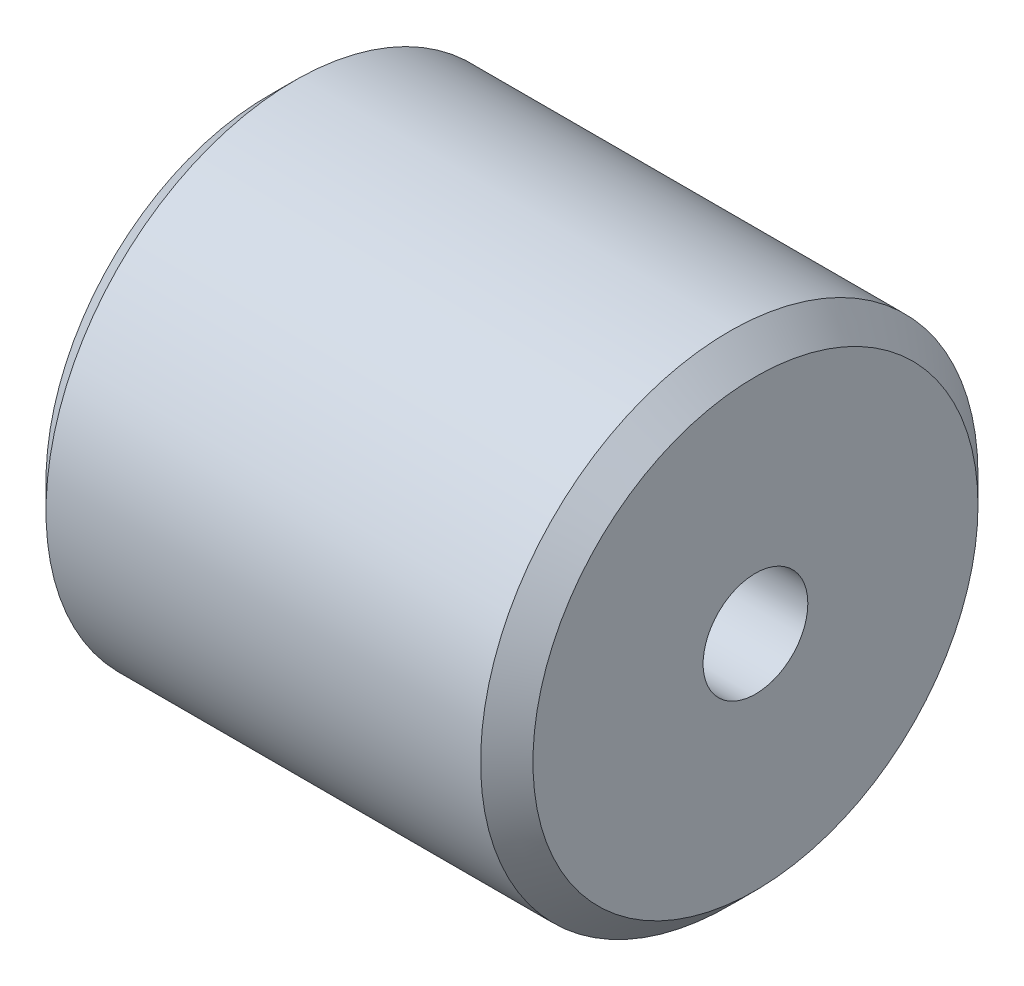
ISO-10303-21;
HEADER;
FILE_DESCRIPTION(('STEP AP214'),'2;1');
FILE_NAME('part.step','',(''),(''),'','','');
FILE_SCHEMA(('AUTOMOTIVE_DESIGN { 1 0 10303 214 1 1 1 1 }'));
ENDSEC;
DATA;
#1=APPLICATION_CONTEXT('core data for automotive mechanical design processes');
#2=APPLICATION_PROTOCOL_DEFINITION('international standard','automotive_design',2000,#1);
#3=PRODUCT_CONTEXT('',#1,'mechanical');
#4=PRODUCT('Part','Part','',(#3));
#5=PRODUCT_RELATED_PRODUCT_CATEGORY('part','',(#4));
#6=PRODUCT_DEFINITION_FORMATION('','',#4);
#7=PRODUCT_DEFINITION_CONTEXT('part definition',#1,'design');
#8=PRODUCT_DEFINITION('design','',#6,#7);
#9=PRODUCT_DEFINITION_SHAPE('','',#8);
#10=(LENGTH_UNIT() NAMED_UNIT(*) SI_UNIT(.MILLI.,.METRE.));
#11=(NAMED_UNIT(*) PLANE_ANGLE_UNIT() SI_UNIT($,.RADIAN.));
#12=(NAMED_UNIT(*) SI_UNIT($,.STERADIAN.) SOLID_ANGLE_UNIT());
#13=UNCERTAINTY_MEASURE_WITH_UNIT(LENGTH_MEASURE(1.E-05),#10,'distance_accuracy_value','');
#14=(GEOMETRIC_REPRESENTATION_CONTEXT(3) GLOBAL_UNCERTAINTY_ASSIGNED_CONTEXT((#13)) GLOBAL_UNIT_ASSIGNED_CONTEXT((#10,
#11,#12)) REPRESENTATION_CONTEXT('',''));
#15=CARTESIAN_POINT('',(0.,0.,0.));
#16=DIRECTION('',(0.,0.,1.));
#17=DIRECTION('',(1.,0.,0.));
#18=AXIS2_PLACEMENT_3D('',#15,#16,#17);
#19=CARTESIAN_POINT('',(-0.699999999999999,0.,0.));
#20=DIRECTION('',(1.,0.,0.));
#21=DIRECTION('',(0.,0.,-1.));
#22=AXIS2_PLACEMENT_3D('',#19,#20,#21);
#23=CYLINDRICAL_SURFACE('',#22,2.);
#24=CARTESIAN_POINT('',(-9.3,0.,0.));
#25=DIRECTION('',(1.,0.,0.));
#26=DIRECTION('',(0.,0.,-1.));
#27=AXIS2_PLACEMENT_3D('',#24,#25,#26);
#28=CIRCLE('',#27,2.);
#29=CARTESIAN_POINT('',(-9.3,0.,-2.));
#30=VERTEX_POINT('',#29);
#31=EDGE_CURVE('E10',#30,#30,#28,.T.);
#32=ORIENTED_EDGE('',*,*,#31,.F.);
#33=EDGE_LOOP('',(#32));
#34=FACE_BOUND('',#33,.T.);
#35=CARTESIAN_POINT('',(9.3,0.,0.));
#36=DIRECTION('',(1.,0.,0.));
#37=DIRECTION('',(0.,0.,-1.));
#38=AXIS2_PLACEMENT_3D('',#35,#36,#37);
#39=CIRCLE('',#38,2.);
#40=CARTESIAN_POINT('',(9.3,0.,-2.));
#41=VERTEX_POINT('',#40);
#42=EDGE_CURVE('E23',#41,#41,#39,.T.);
#43=ORIENTED_EDGE('',*,*,#42,.T.);
#44=EDGE_LOOP('',(#43));
#45=FACE_BOUND('',#44,.T.);
#46=ADVANCED_FACE('F14',(#34,#45),#23,.F.);
#47=CARTESIAN_POINT('',(9.3,0.,0.));
#48=DIRECTION('',(1.,0.,0.));
#49=DIRECTION('',(0.,0.,-1.));
#50=AXIS2_PLACEMENT_3D('',#47,#48,#49);
#51=PLANE('',#50);
#52=CARTESIAN_POINT('',(9.3,0.,0.));
#53=DIRECTION('',(1.,0.,0.));
#54=DIRECTION('',(0.,0.,-1.));
#55=AXIS2_PLACEMENT_3D('',#52,#53,#54);
#56=CIRCLE('',#55,8.5);
#57=CARTESIAN_POINT('',(9.3,0.,-8.5));
#58=VERTEX_POINT('',#57);
#59=EDGE_CURVE('E31',#58,#58,#56,.T.);
#60=ORIENTED_EDGE('',*,*,#59,.T.);
#61=EDGE_LOOP('',(#60));
#62=FACE_BOUND('',#61,.T.);
#63=ORIENTED_EDGE('',*,*,#42,.F.);
#64=EDGE_LOOP('',(#63));
#65=FACE_BOUND('',#64,.T.);
#66=ADVANCED_FACE('F57',(#62,#65),#51,.T.);
#67=CARTESIAN_POINT('',(17.8,0.,0.));
#68=DIRECTION('',(-1.,0.,0.));
#69=DIRECTION('',(0.,0.,1.));
#70=AXIS2_PLACEMENT_3D('',#67,#68,#69);
#71=CONICAL_SURFACE('',#70,0.,0.785398163397449);
#72=CARTESIAN_POINT('',(8.30000000000001,0.,0.));
#73=DIRECTION('',(1.,0.,0.));
#74=DIRECTION('',(0.,0.,-1.));
#75=AXIS2_PLACEMENT_3D('',#72,#73,#74);
#76=CIRCLE('',#75,9.5);
#77=CARTESIAN_POINT('',(8.30000000000002,0.,-9.5));
#78=VERTEX_POINT('',#77);
#79=EDGE_CURVE('E38',#78,#78,#76,.T.);
#80=ORIENTED_EDGE('',*,*,#79,.T.);
#81=EDGE_LOOP('',(#80));
#82=FACE_BOUND('',#81,.T.);
#83=ORIENTED_EDGE('',*,*,#59,.F.);
#84=EDGE_LOOP('',(#83));
#85=FACE_BOUND('',#84,.T.);
#86=ADVANCED_FACE('F49',(#82,#85),#71,.T.);
#87=CARTESIAN_POINT('',(-9.3,0.,0.));
#88=DIRECTION('',(1.,0.,0.));
#89=DIRECTION('',(0.,0.,-1.));
#90=AXIS2_PLACEMENT_3D('',#87,#88,#89);
#91=PLANE('',#90);
#92=CARTESIAN_POINT('',(-9.3,0.,0.));
#93=DIRECTION('',(1.,0.,0.));
#94=DIRECTION('',(0.,0.,-1.));
#95=AXIS2_PLACEMENT_3D('',#92,#93,#94);
#96=CIRCLE('',#95,8.5);
#97=CARTESIAN_POINT('',(-9.3,0.,-8.5));
#98=VERTEX_POINT('',#97);
#99=EDGE_CURVE('E37',#98,#98,#96,.T.);
#100=ORIENTED_EDGE('',*,*,#99,.F.);
#101=EDGE_LOOP('',(#100));
#102=FACE_BOUND('',#101,.T.);
#103=ORIENTED_EDGE('',*,*,#31,.T.);
#104=EDGE_LOOP('',(#103));
#105=FACE_BOUND('',#104,.T.);
#106=ADVANCED_FACE('F46',(#102,#105),#91,.F.);
#107=CARTESIAN_POINT('',(0.,0.,0.));
#108=DIRECTION('',(1.,0.,0.));
#109=DIRECTION('',(0.,0.,-1.));
#110=AXIS2_PLACEMENT_3D('',#107,#108,#109);
#111=CYLINDRICAL_SURFACE('',#110,9.5);
#112=ORIENTED_EDGE('',*,*,#79,.F.);
#113=EDGE_LOOP('',(#112));
#114=FACE_BOUND('',#113,.T.);
#115=CARTESIAN_POINT('',(-8.3,0.,0.));
#116=DIRECTION('',(1.,0.,0.));
#117=DIRECTION('',(0.,0.,-1.));
#118=AXIS2_PLACEMENT_3D('',#115,#116,#117);
#119=CIRCLE('',#118,9.5);
#120=CARTESIAN_POINT('',(-8.3,0.,-9.5));
#121=VERTEX_POINT('',#120);
#122=EDGE_CURVE('E18',#121,#121,#119,.T.);
#123=ORIENTED_EDGE('',*,*,#122,.T.);
#124=EDGE_LOOP('',(#123));
#125=FACE_BOUND('',#124,.T.);
#126=ADVANCED_FACE('F48',(#114,#125),#111,.T.);
#127=CARTESIAN_POINT('',(-17.8,0.,0.));
#128=DIRECTION('',(1.,0.,0.));
#129=DIRECTION('',(0.,1.,0.));
#130=AXIS2_PLACEMENT_3D('',#127,#128,#129);
#131=CONICAL_SURFACE('',#130,0.,0.785398163397449);
#132=ORIENTED_EDGE('',*,*,#99,.T.);
#133=EDGE_LOOP('',(#132));
#134=FACE_BOUND('',#133,.T.);
#135=ORIENTED_EDGE('',*,*,#122,.F.);
#136=EDGE_LOOP('',(#135));
#137=FACE_BOUND('',#136,.T.);
#138=ADVANCED_FACE('F16',(#134,#137),#131,.T.);
#139=CLOSED_SHELL('',(#46,#66,#86,#106,#126,#138));
#140=MANIFOLD_SOLID_BREP('B1',#139);
#141=ADVANCED_BREP_SHAPE_REPRESENTATION('',(#18,#140),#14);
#142=SHAPE_DEFINITION_REPRESENTATION(#9,#141);
ENDSEC;
END-ISO-10303-21;
